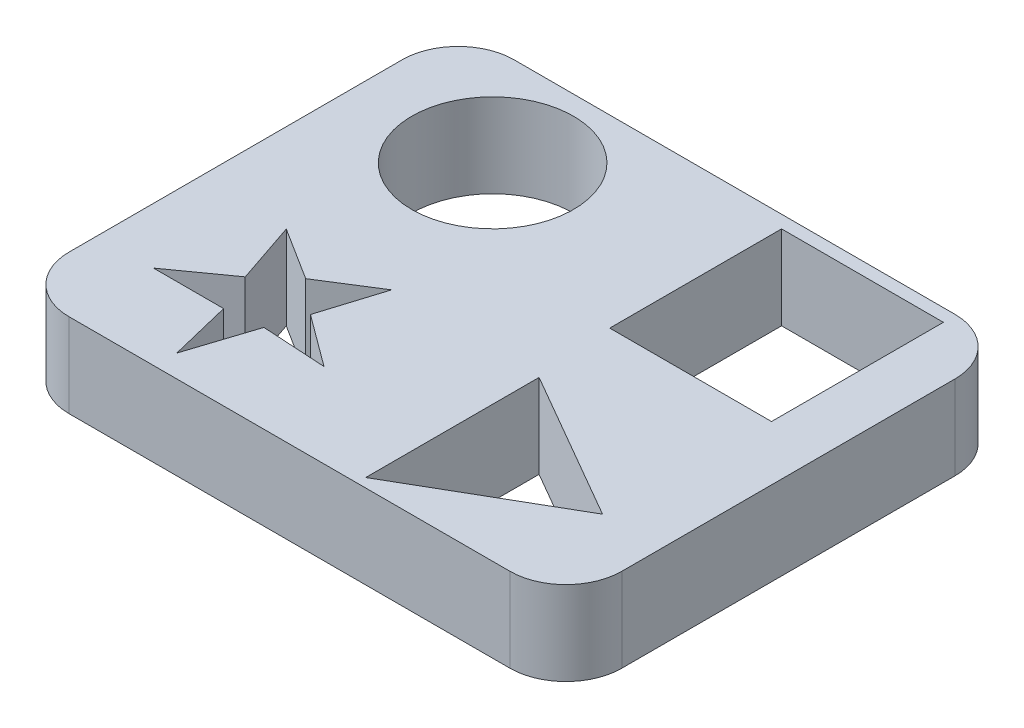
ISO-10303-21;
HEADER;
FILE_DESCRIPTION(('STEP AP214'),'2;1');
FILE_NAME('part.step','',(''),(''),'','','');
FILE_SCHEMA(('AUTOMOTIVE_DESIGN { 1 0 10303 214 1 1 1 1 }'));
ENDSEC;
DATA;
#1=APPLICATION_CONTEXT('core data for automotive mechanical design processes');
#2=APPLICATION_PROTOCOL_DEFINITION('international standard','automotive_design',2000,#1);
#3=PRODUCT_CONTEXT('',#1,'mechanical');
#4=PRODUCT('Part','Part','',(#3));
#5=PRODUCT_RELATED_PRODUCT_CATEGORY('part','',(#4));
#6=PRODUCT_DEFINITION_FORMATION('','',#4);
#7=PRODUCT_DEFINITION_CONTEXT('part definition',#1,'design');
#8=PRODUCT_DEFINITION('design','',#6,#7);
#9=PRODUCT_DEFINITION_SHAPE('','',#8);
#10=(LENGTH_UNIT() NAMED_UNIT(*) SI_UNIT(.MILLI.,.METRE.));
#11=(NAMED_UNIT(*) PLANE_ANGLE_UNIT() SI_UNIT($,.RADIAN.));
#12=(NAMED_UNIT(*) SI_UNIT($,.STERADIAN.) SOLID_ANGLE_UNIT());
#13=UNCERTAINTY_MEASURE_WITH_UNIT(LENGTH_MEASURE(1.E-05),#10,'distance_accuracy_value','');
#14=(GEOMETRIC_REPRESENTATION_CONTEXT(3) GLOBAL_UNCERTAINTY_ASSIGNED_CONTEXT((#13)) GLOBAL_UNIT_ASSIGNED_CONTEXT((#10,
#11,#12)) REPRESENTATION_CONTEXT('',''));
#15=CARTESIAN_POINT('',(0.,0.,0.));
#16=DIRECTION('',(0.,0.,1.));
#17=DIRECTION('',(1.,0.,0.));
#18=AXIS2_PLACEMENT_3D('',#15,#16,#17);
#19=CARTESIAN_POINT('',(6.15117544036753,7.61999999999995,-46.2812088683568));
#20=DIRECTION('',(0.,-1.,0.));
#21=DIRECTION('',(0.,0.,-1.));
#22=AXIS2_PLACEMENT_3D('',#19,#20,#21);
#23=PLANE('',#22);
#24=DIRECTION('',(0.866025403784438,0.,-0.5));
#25=VECTOR('',#24,1.);
#26=CARTESIAN_POINT('',(-7.75829157551048,7.61999999999995,-11.7983996668182));
#27=LINE('',#26,#25);
#28=CARTESIAN_POINT('',(-7.75829157551048,7.61999999999995,-11.7983996668182));
#29=VERTEX_POINT('',#28);
#30=CARTESIAN_POINT('',(5.8675698635448,7.61999999999995,-19.6652944365973));
#31=VERTEX_POINT('',#30);
#32=EDGE_CURVE('E316',#29,#31,#27,.T.);
#33=ORIENTED_EDGE('',*,*,#32,.F.);
#34=DIRECTION('',(0.,0.,1.));
#35=VECTOR('',#34,1.);
#36=CARTESIAN_POINT('',(-7.75829157551048,7.61999999999995,-27.5321892063764));
#37=LINE('',#36,#35);
#38=CARTESIAN_POINT('',(-7.75829157551048,7.61999999999995,-27.5321892063764));
#39=VERTEX_POINT('',#38);
#40=EDGE_CURVE('E324',#39,#29,#37,.T.);
#41=ORIENTED_EDGE('',*,*,#40,.F.);
#42=DIRECTION('',(-0.866025403784439,0.,-0.5));
#43=VECTOR('',#42,1.);
#44=CARTESIAN_POINT('',(5.8675698635448,7.61999999999995,-19.6652944365973));
#45=LINE('',#44,#43);
#46=EDGE_CURVE('E319',#31,#39,#45,.T.);
#47=ORIENTED_EDGE('',*,*,#46,.F.);
#48=EDGE_LOOP('',(#33,#41,#47));
#49=FACE_BOUND('',#48,.T.);
#50=CARTESIAN_POINT('',(6.15117544036753,7.61999999999995,-46.2812088683568));
#51=DIRECTION('',(0.,1.,0.));
#52=DIRECTION('',(0.,0.,-1.));
#53=AXIS2_PLACEMENT_3D('',#50,#51,#52);
#54=CIRCLE('',#53,5.08000000000001);
#55=CARTESIAN_POINT('',(11.2311754403675,7.61999999999995,-46.2812088683568));
#56=VERTEX_POINT('',#55);
#57=CARTESIAN_POINT('',(6.15117544036754,7.61999999999995,-51.3612088683568));
#58=VERTEX_POINT('',#57);
#59=EDGE_CURVE('E400',#56,#58,#54,.T.);
#60=ORIENTED_EDGE('',*,*,#59,.T.);
#61=DIRECTION('',(-1.,0.,0.));
#62=VECTOR('',#61,1.);
#63=CARTESIAN_POINT('',(-33.8538245596325,7.61999999999995,-51.3612088683568));
#64=LINE('',#63,#62);
#65=CARTESIAN_POINT('',(-33.8538245596325,7.61999999999995,-51.3612088683568));
#66=VERTEX_POINT('',#65);
#67=EDGE_CURVE('E404',#58,#66,#64,.T.);
#68=ORIENTED_EDGE('',*,*,#67,.T.);
#69=CARTESIAN_POINT('',(-33.8538245596325,7.61999999999995,-46.2812088683568));
#70=DIRECTION('',(0.,1.,0.));
#71=DIRECTION('',(0.,0.,1.));
#72=AXIS2_PLACEMENT_3D('',#69,#70,#71);
#73=CIRCLE('',#72,5.08);
#74=CARTESIAN_POINT('',(-38.9338245596325,7.61999999999995,-46.2812088683568));
#75=VERTEX_POINT('',#74);
#76=EDGE_CURVE('E408',#66,#75,#73,.T.);
#77=ORIENTED_EDGE('',*,*,#76,.T.);
#78=DIRECTION('',(0.,0.,1.));
#79=VECTOR('',#78,1.);
#80=CARTESIAN_POINT('',(-38.9338245596325,7.61999999999995,-46.2812088683568));
#81=LINE('',#80,#79);
#82=CARTESIAN_POINT('',(-38.9338245596325,7.61999999999995,-16.0552088683568));
#83=VERTEX_POINT('',#82);
#84=EDGE_CURVE('E411',#75,#83,#81,.T.);
#85=ORIENTED_EDGE('',*,*,#84,.T.);
#86=CARTESIAN_POINT('',(-33.8538245596325,7.61999999999995,-16.0552088683568));
#87=DIRECTION('',(0.,1.,0.));
#88=DIRECTION('',(0.,0.,1.));
#89=AXIS2_PLACEMENT_3D('',#86,#87,#88);
#90=CIRCLE('',#89,5.08);
#91=CARTESIAN_POINT('',(-33.8538245596325,7.61999999999995,-10.9752088683568));
#92=VERTEX_POINT('',#91);
#93=EDGE_CURVE('E414',#83,#92,#90,.T.);
#94=ORIENTED_EDGE('',*,*,#93,.T.);
#95=DIRECTION('',(1.,0.,0.));
#96=VECTOR('',#95,1.);
#97=CARTESIAN_POINT('',(-33.8538245596325,7.61999999999995,-10.9752088683568));
#98=LINE('',#97,#96);
#99=CARTESIAN_POINT('',(6.15117544036754,7.61999999999995,-10.9752088683568));
#100=VERTEX_POINT('',#99);
#101=EDGE_CURVE('E417',#92,#100,#98,.T.);
#102=ORIENTED_EDGE('',*,*,#101,.T.);
#103=CARTESIAN_POINT('',(6.15117544036754,7.61999999999995,-16.0552088683568));
#104=DIRECTION('',(0.,1.,0.));
#105=DIRECTION('',(0.,0.,1.));
#106=AXIS2_PLACEMENT_3D('',#103,#104,#105);
#107=CIRCLE('',#106,5.08);
#108=CARTESIAN_POINT('',(11.2311754403675,7.61999999999995,-16.0552088683568));
#109=VERTEX_POINT('',#108);
#110=EDGE_CURVE('E420',#100,#109,#107,.T.);
#111=ORIENTED_EDGE('',*,*,#110,.T.);
#112=DIRECTION('',(0.,0.,-1.));
#113=VECTOR('',#112,1.);
#114=CARTESIAN_POINT('',(11.2311754403675,7.61999999999995,-46.2812088683568));
#115=LINE('',#114,#113);
#116=EDGE_CURVE('E423',#109,#56,#115,.T.);
#117=ORIENTED_EDGE('',*,*,#116,.T.);
#118=EDGE_LOOP('',(#60,#68,#77,#85,#94,#102,#111,#117));
#119=FACE_BOUND('',#118,.T.);
#120=DIRECTION('',(0.,0.,-1.));
#121=VECTOR('',#120,1.);
#122=CARTESIAN_POINT('',(6.2551989286152,7.61999999999995,-50.2080426709111));
#123=LINE('',#122,#121);
#124=CARTESIAN_POINT('',(6.2551989286152,7.61999999999995,-34.6135933478244));
#125=VERTEX_POINT('',#124);
#126=CARTESIAN_POINT('',(6.2551989286152,7.61999999999995,-50.2080426709111));
#127=VERTEX_POINT('',#126);
#128=EDGE_CURVE('E357',#125,#127,#123,.T.);
#129=ORIENTED_EDGE('',*,*,#128,.F.);
#130=DIRECTION('',(1.,0.,0.));
#131=VECTOR('',#130,1.);
#132=CARTESIAN_POINT('',(6.2551989286152,7.61999999999995,-34.6135933478244));
#133=LINE('',#132,#131);
#134=CARTESIAN_POINT('',(-8.42854696194583,7.61999999999995,-34.6135933478244));
#135=VERTEX_POINT('',#134);
#136=EDGE_CURVE('E368',#135,#125,#133,.T.);
#137=ORIENTED_EDGE('',*,*,#136,.F.);
#138=DIRECTION('',(0.,0.,1.));
#139=VECTOR('',#138,1.);
#140=CARTESIAN_POINT('',(-8.42854696194583,7.61999999999995,-50.2080426709111));
#141=LINE('',#140,#139);
#142=CARTESIAN_POINT('',(-8.42854696194583,7.61999999999995,-50.2080426709111));
#143=VERTEX_POINT('',#142);
#144=EDGE_CURVE('E364',#143,#135,#141,.T.);
#145=ORIENTED_EDGE('',*,*,#144,.F.);
#146=DIRECTION('',(-1.,0.,0.));
#147=VECTOR('',#146,1.);
#148=CARTESIAN_POINT('',(6.2551989286152,7.61999999999995,-50.2080426709111));
#149=LINE('',#148,#147);
#150=EDGE_CURVE('E360',#127,#143,#149,.T.);
#151=ORIENTED_EDGE('',*,*,#150,.F.);
#152=EDGE_LOOP('',(#129,#137,#145,#151));
#153=FACE_BOUND('',#152,.T.);
#154=CARTESIAN_POINT('',(-26.7287845306443,7.61999999999995,-42.2880938585788));
#155=DIRECTION('',(0.,1.,0.));
#156=DIRECTION('',(0.,0.,1.));
#157=AXIS2_PLACEMENT_3D('',#154,#155,#156);
#158=CIRCLE('',#157,7.33850889206838);
#159=CARTESIAN_POINT('',(-26.7287845306443,7.61999999999995,-34.9495849665104));
#160=VERTEX_POINT('',#159);
#161=EDGE_CURVE('E349',#160,#160,#158,.T.);
#162=ORIENTED_EDGE('',*,*,#161,.F.);
#163=EDGE_LOOP('',(#162));
#164=FACE_BOUND('',#163,.T.);
#165=DIRECTION('',(1.,0.,0.));
#166=VECTOR('',#165,1.);
#167=CARTESIAN_POINT('',(-27.4791985108445,7.61999999999995,-18.6293191128942));
#168=LINE('',#167,#166);
#169=CARTESIAN_POINT('',(-33.8477430683376,7.61999999999995,-18.6293191128942));
#170=VERTEX_POINT('',#169);
#171=CARTESIAN_POINT('',(-27.4791985108445,7.61999999999995,-18.6293191128942));
#172=VERTEX_POINT('',#171);
#173=EDGE_CURVE('E207',#170,#172,#168,.T.);
#174=ORIENTED_EDGE('',*,*,#173,.F.);
#175=DIRECTION('',(-0.813183962352781,0.,0.582006738253288));
#176=VECTOR('',#175,1.);
#177=CARTESIAN_POINT('',(-33.8477430683376,7.61999999999995,-18.6293191128942));
#178=LINE('',#177,#176);
#179=CARTESIAN_POINT('',(-28.9932779186337,7.61999999999995,-22.1037253463484));
#180=VERTEX_POINT('',#179);
#181=EDGE_CURVE('E254',#180,#170,#178,.T.);
#182=ORIENTED_EDGE('',*,*,#181,.F.);
#183=DIRECTION('',(0.320025610898666,0.,0.947408891856592));
#184=VECTOR('',#183,1.);
#185=CARTESIAN_POINT('',(-28.9932779186337,7.61999999999995,-22.1037253463484));
#186=LINE('',#185,#184);
#187=CARTESIAN_POINT('',(-30.8922365973066,7.61999999999995,-27.7254327228016));
#188=VERTEX_POINT('',#187);
#189=EDGE_CURVE('E251',#188,#180,#186,.T.);
#190=ORIENTED_EDGE('',*,*,#189,.F.);
#191=DIRECTION('',(-0.845502621745261,0.,-0.533971269472328));
#192=VECTOR('',#191,1.);
#193=CARTESIAN_POINT('',(-30.8922365973066,7.61999999999995,-27.7254327228016));
#194=LINE('',#193,#192);
#195=CARTESIAN_POINT('',(-26.1101266732079,7.61999999999995,-24.7053246341284));
#196=VERTEX_POINT('',#195);
#197=EDGE_CURVE('E248',#196,#188,#194,.T.);
#198=ORIENTED_EDGE('',*,*,#197,.F.);
#199=DIRECTION('',(-0.845502621745238,0.,0.533971269472364));
#200=VECTOR('',#199,1.);
#201=CARTESIAN_POINT('',(-26.1101266732079,7.61999999999995,-24.7053246341284));
#202=LINE('',#201,#200);
#203=CARTESIAN_POINT('',(-21.3280167491095,7.61999999999995,-27.7254327228017));
#204=VERTEX_POINT('',#203);
#205=EDGE_CURVE('E245',#204,#196,#202,.T.);
#206=ORIENTED_EDGE('',*,*,#205,.F.);
#207=DIRECTION('',(0.296978964116433,0.,-0.954884021686576));
#208=VECTOR('',#207,1.);
#209=CARTESIAN_POINT('',(-23.0764268128532,7.61999999999995,-22.1037253463484));
#210=LINE('',#209,#208);
#211=CARTESIAN_POINT('',(-23.0764268128532,7.61999999999995,-22.1037253463484));
#212=VERTEX_POINT('',#211);
#213=EDGE_CURVE('E242',#212,#204,#210,.T.);
#214=ORIENTED_EDGE('',*,*,#213,.F.);
#215=DIRECTION('',(-0.804372401510617,0.,-0.594125441037533));
#216=VECTOR('',#215,1.);
#217=CARTESIAN_POINT('',(-18.3725102780783,7.61999999999995,-18.6293191128944));
#218=LINE('',#217,#216);
#219=CARTESIAN_POINT('',(-18.3725102780783,7.61999999999995,-18.6293191128944));
#220=VERTEX_POINT('',#219);
#221=EDGE_CURVE('E239',#220,#212,#218,.T.);
#222=ORIENTED_EDGE('',*,*,#221,.F.);
#223=DIRECTION('',(0.998228907565858,0.,0.0594898991415599));
#224=VECTOR('',#223,1.);
#225=CARTESIAN_POINT('',(-24.1712381899674,7.61999999999995,-18.9748969017292));
#226=LINE('',#225,#224);
#227=CARTESIAN_POINT('',(-24.1712381899674,7.61999999999995,-18.9748969017292));
#228=VERTEX_POINT('',#227);
#229=EDGE_CURVE('E234',#228,#220,#226,.T.);
#230=ORIENTED_EDGE('',*,*,#229,.F.);
#231=DIRECTION('',(0.309016994374938,0.,-0.951056516295157));
#232=VECTOR('',#231,1.);
#233=CARTESIAN_POINT('',(-26.1101266732079,7.61999999999995,-13.0076117364411));
#234=LINE('',#233,#232);
#235=CARTESIAN_POINT('',(-26.1101266732079,7.61999999999995,-13.0076117364411));
#236=VERTEX_POINT('',#235);
#237=EDGE_CURVE('E230',#236,#228,#234,.T.);
#238=ORIENTED_EDGE('',*,*,#237,.F.);
#239=DIRECTION('',(0.236617465882406,0.,0.971602889476657));
#240=VECTOR('',#239,1.);
#241=CARTESIAN_POINT('',(-26.1101266732079,7.61999999999995,-13.0076117364411));
#242=LINE('',#241,#240);
#243=EDGE_CURVE('E216',#172,#236,#242,.T.);
#244=ORIENTED_EDGE('',*,*,#243,.F.);
#245=EDGE_LOOP('',(#174,#182,#190,#198,#206,#214,#222,#230,#238,#244));
#246=FACE_BOUND('',#245,.T.);
#247=ADVANCED_FACE('F39',(#49,#119,#153,#164,#246),#23,.F.);
#248=CARTESIAN_POINT('',(6.15117544036753,0.,-46.2812088683568));
#249=DIRECTION('',(0.,-1.,0.));
#250=DIRECTION('',(0.,0.,-1.));
#251=AXIS2_PLACEMENT_3D('',#248,#249,#250);
#252=PLANE('',#251);
#253=DIRECTION('',(1.,0.,0.));
#254=VECTOR('',#253,1.);
#255=CARTESIAN_POINT('',(6.2551989286152,0.,-34.6135933478244));
#256=LINE('',#255,#254);
#257=CARTESIAN_POINT('',(-8.42854696194583,0.,-34.6135933478244));
#258=VERTEX_POINT('',#257);
#259=CARTESIAN_POINT('',(6.2551989286152,0.,-34.6135933478244));
#260=VERTEX_POINT('',#259);
#261=EDGE_CURVE('E361',#258,#260,#256,.T.);
#262=ORIENTED_EDGE('',*,*,#261,.T.);
#263=DIRECTION('',(0.,0.,-1.));
#264=VECTOR('',#263,1.);
#265=CARTESIAN_POINT('',(6.2551989286152,0.,-50.2080426709111));
#266=LINE('',#265,#264);
#267=CARTESIAN_POINT('',(6.2551989286152,0.,-50.2080426709111));
#268=VERTEX_POINT('',#267);
#269=EDGE_CURVE('E353',#260,#268,#266,.T.);
#270=ORIENTED_EDGE('',*,*,#269,.T.);
#271=DIRECTION('',(-1.,0.,0.));
#272=VECTOR('',#271,1.);
#273=CARTESIAN_POINT('',(6.2551989286152,0.,-50.2080426709111));
#274=LINE('',#273,#272);
#275=CARTESIAN_POINT('',(-8.42854696194583,0.,-50.2080426709111));
#276=VERTEX_POINT('',#275);
#277=EDGE_CURVE('E375',#268,#276,#274,.T.);
#278=ORIENTED_EDGE('',*,*,#277,.T.);
#279=DIRECTION('',(0.,0.,1.));
#280=VECTOR('',#279,1.);
#281=CARTESIAN_POINT('',(-8.42854696194583,0.,-50.2080426709111));
#282=LINE('',#281,#280);
#283=EDGE_CURVE('E379',#276,#258,#282,.T.);
#284=ORIENTED_EDGE('',*,*,#283,.T.);
#285=EDGE_LOOP('',(#262,#270,#278,#284));
#286=FACE_BOUND('',#285,.T.);
#287=CARTESIAN_POINT('',(6.15117544036753,0.,-46.2812088683568));
#288=DIRECTION('',(0.,1.,0.));
#289=DIRECTION('',(0.,0.,-1.));
#290=AXIS2_PLACEMENT_3D('',#287,#288,#289);
#291=CIRCLE('',#290,5.08000000000001);
#292=CARTESIAN_POINT('',(11.2311754403675,0.,-46.2812088683568));
#293=VERTEX_POINT('',#292);
#294=CARTESIAN_POINT('',(6.15117544036754,0.,-51.3612088683568));
#295=VERTEX_POINT('',#294);
#296=EDGE_CURVE('E399',#293,#295,#291,.T.);
#297=ORIENTED_EDGE('',*,*,#296,.F.);
#298=DIRECTION('',(0.,0.,-1.));
#299=VECTOR('',#298,1.);
#300=CARTESIAN_POINT('',(11.2311754403675,0.,-46.2812088683568));
#301=LINE('',#300,#299);
#302=CARTESIAN_POINT('',(11.2311754403675,0.,-16.0552088683568));
#303=VERTEX_POINT('',#302);
#304=EDGE_CURVE('E405',#303,#293,#301,.T.);
#305=ORIENTED_EDGE('',*,*,#304,.F.);
#306=CARTESIAN_POINT('',(6.15117544036754,0.,-16.0552088683568));
#307=DIRECTION('',(0.,1.,0.));
#308=DIRECTION('',(0.,0.,1.));
#309=AXIS2_PLACEMENT_3D('',#306,#307,#308);
#310=CIRCLE('',#309,5.08);
#311=CARTESIAN_POINT('',(6.15117544036754,0.,-10.9752088683568));
#312=VERTEX_POINT('',#311);
#313=EDGE_CURVE('E445',#312,#303,#310,.T.);
#314=ORIENTED_EDGE('',*,*,#313,.F.);
#315=DIRECTION('',(1.,0.,0.));
#316=VECTOR('',#315,1.);
#317=CARTESIAN_POINT('',(-33.8538245596325,0.,-10.9752088683568));
#318=LINE('',#317,#316);
#319=CARTESIAN_POINT('',(-33.8538245596325,0.,-10.9752088683568));
#320=VERTEX_POINT('',#319);
#321=EDGE_CURVE('E442',#320,#312,#318,.T.);
#322=ORIENTED_EDGE('',*,*,#321,.F.);
#323=CARTESIAN_POINT('',(-33.8538245596325,0.,-16.0552088683568));
#324=DIRECTION('',(0.,1.,0.));
#325=DIRECTION('',(0.,0.,1.));
#326=AXIS2_PLACEMENT_3D('',#323,#324,#325);
#327=CIRCLE('',#326,5.08);
#328=CARTESIAN_POINT('',(-38.9338245596325,0.,-16.0552088683568));
#329=VERTEX_POINT('',#328);
#330=EDGE_CURVE('E439',#329,#320,#327,.T.);
#331=ORIENTED_EDGE('',*,*,#330,.F.);
#332=DIRECTION('',(0.,0.,1.));
#333=VECTOR('',#332,1.);
#334=CARTESIAN_POINT('',(-38.9338245596325,0.,-46.2812088683568));
#335=LINE('',#334,#333);
#336=CARTESIAN_POINT('',(-38.9338245596325,0.,-46.2812088683568));
#337=VERTEX_POINT('',#336);
#338=EDGE_CURVE('E436',#337,#329,#335,.T.);
#339=ORIENTED_EDGE('',*,*,#338,.F.);
#340=CARTESIAN_POINT('',(-33.8538245596325,0.,-46.2812088683568));
#341=DIRECTION('',(0.,1.,0.));
#342=DIRECTION('',(0.,0.,1.));
#343=AXIS2_PLACEMENT_3D('',#340,#341,#342);
#344=CIRCLE('',#343,5.08);
#345=CARTESIAN_POINT('',(-33.8538245596325,0.,-51.3612088683568));
#346=VERTEX_POINT('',#345);
#347=EDGE_CURVE('E433',#346,#337,#344,.T.);
#348=ORIENTED_EDGE('',*,*,#347,.F.);
#349=DIRECTION('',(-1.,0.,0.));
#350=VECTOR('',#349,1.);
#351=CARTESIAN_POINT('',(-33.8538245596325,0.,-51.3612088683568));
#352=LINE('',#351,#350);
#353=EDGE_CURVE('E430',#295,#346,#352,.T.);
#354=ORIENTED_EDGE('',*,*,#353,.F.);
#355=EDGE_LOOP('',(#297,#305,#314,#322,#331,#339,#348,#354));
#356=FACE_BOUND('',#355,.T.);
#357=CARTESIAN_POINT('',(-26.7287845306443,0.,-42.2880938585788));
#358=DIRECTION('',(0.,1.,0.));
#359=DIRECTION('',(0.,0.,1.));
#360=AXIS2_PLACEMENT_3D('',#357,#358,#359);
#361=CIRCLE('',#360,7.33850889206838);
#362=CARTESIAN_POINT('',(-26.7287845306443,0.,-34.9495849665104));
#363=VERTEX_POINT('',#362);
#364=EDGE_CURVE('E348',#363,#363,#361,.T.);
#365=ORIENTED_EDGE('',*,*,#364,.T.);
#366=EDGE_LOOP('',(#365));
#367=FACE_BOUND('',#366,.T.);
#368=DIRECTION('',(0.,0.,1.));
#369=VECTOR('',#368,1.);
#370=CARTESIAN_POINT('',(-7.75829157551048,0.,-27.5321892063764));
#371=LINE('',#370,#369);
#372=CARTESIAN_POINT('',(-7.75829157551048,0.,-27.5321892063764));
#373=VERTEX_POINT('',#372);
#374=CARTESIAN_POINT('',(-7.75829157551048,0.,-11.7983996668182));
#375=VERTEX_POINT('',#374);
#376=EDGE_CURVE('E320',#373,#375,#371,.T.);
#377=ORIENTED_EDGE('',*,*,#376,.T.);
#378=DIRECTION('',(0.866025403784438,0.,-0.5));
#379=VECTOR('',#378,1.);
#380=CARTESIAN_POINT('',(-7.75829157551048,0.,-11.7983996668182));
#381=LINE('',#380,#379);
#382=CARTESIAN_POINT('',(5.8675698635448,0.,-19.6652944365973));
#383=VERTEX_POINT('',#382);
#384=EDGE_CURVE('E225',#375,#383,#381,.T.);
#385=ORIENTED_EDGE('',*,*,#384,.T.);
#386=DIRECTION('',(-0.866025403784439,0.,-0.5));
#387=VECTOR('',#386,1.);
#388=CARTESIAN_POINT('',(5.8675698635448,0.,-19.6652944365973));
#389=LINE('',#388,#387);
#390=EDGE_CURVE('E331',#383,#373,#389,.T.);
#391=ORIENTED_EDGE('',*,*,#390,.T.);
#392=EDGE_LOOP('',(#377,#385,#391));
#393=FACE_BOUND('',#392,.T.);
#394=DIRECTION('',(-0.813183962352781,0.,0.582006738253288));
#395=VECTOR('',#394,1.);
#396=CARTESIAN_POINT('',(-33.8477430683376,0.,-18.6293191128942));
#397=LINE('',#396,#395);
#398=CARTESIAN_POINT('',(-28.9932779186337,0.,-22.1037253463484));
#399=VERTEX_POINT('',#398);
#400=CARTESIAN_POINT('',(-33.8477430683376,0.,-18.6293191128942));
#401=VERTEX_POINT('',#400);
#402=EDGE_CURVE('E217',#399,#401,#397,.T.);
#403=ORIENTED_EDGE('',*,*,#402,.T.);
#404=DIRECTION('',(1.,0.,0.));
#405=VECTOR('',#404,1.);
#406=CARTESIAN_POINT('',(-27.4791985108445,0.,-18.6293191128942));
#407=LINE('',#406,#405);
#408=CARTESIAN_POINT('',(-27.4791985108445,0.,-18.6293191128942));
#409=VERTEX_POINT('',#408);
#410=EDGE_CURVE('E63',#401,#409,#407,.T.);
#411=ORIENTED_EDGE('',*,*,#410,.T.);
#412=DIRECTION('',(0.236617465882406,0.,0.971602889476657));
#413=VECTOR('',#412,1.);
#414=CARTESIAN_POINT('',(-26.1101266732079,0.,-13.0076117364411));
#415=LINE('',#414,#413);
#416=CARTESIAN_POINT('',(-26.1101266732079,0.,-13.0076117364411));
#417=VERTEX_POINT('',#416);
#418=EDGE_CURVE('E223',#409,#417,#415,.T.);
#419=ORIENTED_EDGE('',*,*,#418,.T.);
#420=DIRECTION('',(0.309016994374938,0.,-0.951056516295157));
#421=VECTOR('',#420,1.);
#422=CARTESIAN_POINT('',(-26.1101266732079,0.,-13.0076117364411));
#423=LINE('',#422,#421);
#424=CARTESIAN_POINT('',(-24.1712381899674,0.,-18.9748969017292));
#425=VERTEX_POINT('',#424);
#426=EDGE_CURVE('E261',#417,#425,#423,.T.);
#427=ORIENTED_EDGE('',*,*,#426,.T.);
#428=DIRECTION('',(0.998228907565858,0.,0.0594898991415599));
#429=VECTOR('',#428,1.);
#430=CARTESIAN_POINT('',(-24.1712381899674,0.,-18.9748969017292));
#431=LINE('',#430,#429);
#432=CARTESIAN_POINT('',(-18.3725102780783,0.,-18.6293191128944));
#433=VERTEX_POINT('',#432);
#434=EDGE_CURVE('E265',#425,#433,#431,.T.);
#435=ORIENTED_EDGE('',*,*,#434,.T.);
#436=DIRECTION('',(-0.804372401510617,0.,-0.594125441037533));
#437=VECTOR('',#436,1.);
#438=CARTESIAN_POINT('',(-18.3725102780783,0.,-18.6293191128944));
#439=LINE('',#438,#437);
#440=CARTESIAN_POINT('',(-23.0764268128532,0.,-22.1037253463484));
#441=VERTEX_POINT('',#440);
#442=EDGE_CURVE('E269',#433,#441,#439,.T.);
#443=ORIENTED_EDGE('',*,*,#442,.T.);
#444=DIRECTION('',(0.296978964116433,0.,-0.954884021686576));
#445=VECTOR('',#444,1.);
#446=CARTESIAN_POINT('',(-23.0764268128532,0.,-22.1037253463484));
#447=LINE('',#446,#445);
#448=CARTESIAN_POINT('',(-21.3280167491095,0.,-27.7254327228017));
#449=VERTEX_POINT('',#448);
#450=EDGE_CURVE('E273',#441,#449,#447,.T.);
#451=ORIENTED_EDGE('',*,*,#450,.T.);
#452=DIRECTION('',(-0.845502621745238,0.,0.533971269472364));
#453=VECTOR('',#452,1.);
#454=CARTESIAN_POINT('',(-26.1101266732079,0.,-24.7053246341284));
#455=LINE('',#454,#453);
#456=CARTESIAN_POINT('',(-26.1101266732079,0.,-24.7053246341284));
#457=VERTEX_POINT('',#456);
#458=EDGE_CURVE('E277',#449,#457,#455,.T.);
#459=ORIENTED_EDGE('',*,*,#458,.T.);
#460=DIRECTION('',(-0.845502621745261,0.,-0.533971269472328));
#461=VECTOR('',#460,1.);
#462=CARTESIAN_POINT('',(-30.8922365973066,0.,-27.7254327228016));
#463=LINE('',#462,#461);
#464=CARTESIAN_POINT('',(-30.8922365973066,0.,-27.7254327228016));
#465=VERTEX_POINT('',#464);
#466=EDGE_CURVE('E281',#457,#465,#463,.T.);
#467=ORIENTED_EDGE('',*,*,#466,.T.);
#468=DIRECTION('',(0.320025610898666,0.,0.947408891856592));
#469=VECTOR('',#468,1.);
#470=CARTESIAN_POINT('',(-28.9932779186337,0.,-22.1037253463484));
#471=LINE('',#470,#469);
#472=EDGE_CURVE('E285',#465,#399,#471,.T.);
#473=ORIENTED_EDGE('',*,*,#472,.T.);
#474=EDGE_LOOP('',(#403,#411,#419,#427,#435,#443,#451,#459,#467,#473));
#475=FACE_BOUND('',#474,.T.);
#476=ADVANCED_FACE('F484',(#286,#356,#367,#393,#475),#252,.T.);
#477=CARTESIAN_POINT('',(6.15117544036753,7.61999999999995,-46.2812088683568));
#478=DIRECTION('',(0.,-1.,0.));
#479=DIRECTION('',(0.,0.,-1.));
#480=AXIS2_PLACEMENT_3D('',#477,#478,#479);
#481=CYLINDRICAL_SURFACE('',#480,5.08000000000001);
#482=ORIENTED_EDGE('',*,*,#296,.T.);
#483=DIRECTION('',(0.,-1.,0.));
#484=VECTOR('',#483,1.);
#485=CARTESIAN_POINT('',(6.15117544036754,7.61999999999995,-51.3612088683568));
#486=LINE('',#485,#484);
#487=EDGE_CURVE('E11',#58,#295,#486,.T.);
#488=ORIENTED_EDGE('',*,*,#487,.F.);
#489=ORIENTED_EDGE('',*,*,#59,.F.);
#490=DIRECTION('',(0.,-1.,0.));
#491=VECTOR('',#490,1.);
#492=CARTESIAN_POINT('',(11.2311754403675,7.61999999999995,-46.2812088683568));
#493=LINE('',#492,#491);
#494=EDGE_CURVE('E426',#56,#293,#493,.T.);
#495=ORIENTED_EDGE('',*,*,#494,.T.);
#496=EDGE_LOOP('',(#482,#488,#489,#495));
#497=FACE_BOUND('',#496,.T.);
#498=ADVANCED_FACE('F41',(#497),#481,.T.);
#499=CARTESIAN_POINT('',(-33.8538245596325,7.61999999999995,-51.3612088683568));
#500=DIRECTION('',(0.,0.,1.));
#501=DIRECTION('',(1.,0.,0.));
#502=AXIS2_PLACEMENT_3D('',#499,#500,#501);
#503=PLANE('',#502);
#504=ORIENTED_EDGE('',*,*,#353,.T.);
#505=DIRECTION('',(0.,-1.,0.));
#506=VECTOR('',#505,1.);
#507=CARTESIAN_POINT('',(-33.8538245596325,7.61999999999995,-51.3612088683568));
#508=LINE('',#507,#506);
#509=EDGE_CURVE('E48',#66,#346,#508,.T.);
#510=ORIENTED_EDGE('',*,*,#509,.F.);
#511=ORIENTED_EDGE('',*,*,#67,.F.);
#512=ORIENTED_EDGE('',*,*,#487,.T.);
#513=EDGE_LOOP('',(#504,#510,#511,#512));
#514=FACE_BOUND('',#513,.T.);
#515=ADVANCED_FACE('F502',(#514),#503,.F.);
#516=CARTESIAN_POINT('',(-33.8538245596325,7.61999999999995,-46.2812088683568));
#517=DIRECTION('',(0.,-1.,0.));
#518=DIRECTION('',(0.,0.,-1.));
#519=AXIS2_PLACEMENT_3D('',#516,#517,#518);
#520=CYLINDRICAL_SURFACE('',#519,5.08);
#521=ORIENTED_EDGE('',*,*,#347,.T.);
#522=DIRECTION('',(0.,-1.,0.));
#523=VECTOR('',#522,1.);
#524=CARTESIAN_POINT('',(-38.9338245596325,7.61999999999995,-46.2812088683568));
#525=LINE('',#524,#523);
#526=EDGE_CURVE('E469',#75,#337,#525,.T.);
#527=ORIENTED_EDGE('',*,*,#526,.F.);
#528=ORIENTED_EDGE('',*,*,#76,.F.);
#529=ORIENTED_EDGE('',*,*,#509,.T.);
#530=EDGE_LOOP('',(#521,#527,#528,#529));
#531=FACE_BOUND('',#530,.T.);
#532=ADVANCED_FACE('F478',(#531),#520,.T.);
#533=CARTESIAN_POINT('',(-38.9338245596325,7.61999999999995,-46.2812088683568));
#534=DIRECTION('',(1.,0.,0.));
#535=DIRECTION('',(0.,0.,-1.));
#536=AXIS2_PLACEMENT_3D('',#533,#534,#535);
#537=PLANE('',#536);
#538=ORIENTED_EDGE('',*,*,#338,.T.);
#539=DIRECTION('',(0.,-1.,0.));
#540=VECTOR('',#539,1.);
#541=CARTESIAN_POINT('',(-38.9338245596325,7.61999999999995,-16.0552088683568));
#542=LINE('',#541,#540);
#543=EDGE_CURVE('E465',#83,#329,#542,.T.);
#544=ORIENTED_EDGE('',*,*,#543,.F.);
#545=ORIENTED_EDGE('',*,*,#84,.F.);
#546=ORIENTED_EDGE('',*,*,#526,.T.);
#547=EDGE_LOOP('',(#538,#544,#545,#546));
#548=FACE_BOUND('',#547,.T.);
#549=ADVANCED_FACE('F490',(#548),#537,.F.);
#550=CARTESIAN_POINT('',(-33.8538245596325,7.61999999999995,-16.0552088683568));
#551=DIRECTION('',(0.,-1.,0.));
#552=DIRECTION('',(0.,0.,-1.));
#553=AXIS2_PLACEMENT_3D('',#550,#551,#552);
#554=CYLINDRICAL_SURFACE('',#553,5.08);
#555=ORIENTED_EDGE('',*,*,#330,.T.);
#556=DIRECTION('',(0.,-1.,0.));
#557=VECTOR('',#556,1.);
#558=CARTESIAN_POINT('',(-33.8538245596325,7.61999999999995,-10.9752088683568));
#559=LINE('',#558,#557);
#560=EDGE_CURVE('E461',#92,#320,#559,.T.);
#561=ORIENTED_EDGE('',*,*,#560,.F.);
#562=ORIENTED_EDGE('',*,*,#93,.F.);
#563=ORIENTED_EDGE('',*,*,#543,.T.);
#564=EDGE_LOOP('',(#555,#561,#562,#563));
#565=FACE_BOUND('',#564,.T.);
#566=ADVANCED_FACE('F494',(#565),#554,.T.);
#567=CARTESIAN_POINT('',(-33.8538245596325,7.61999999999995,-10.9752088683568));
#568=DIRECTION('',(0.,0.,-1.));
#569=DIRECTION('',(-1.,0.,0.));
#570=AXIS2_PLACEMENT_3D('',#567,#568,#569);
#571=PLANE('',#570);
#572=ORIENTED_EDGE('',*,*,#321,.T.);
#573=DIRECTION('',(0.,-1.,0.));
#574=VECTOR('',#573,1.);
#575=CARTESIAN_POINT('',(6.15117544036754,7.61999999999995,-10.9752088683568));
#576=LINE('',#575,#574);
#577=EDGE_CURVE('E457',#100,#312,#576,.T.);
#578=ORIENTED_EDGE('',*,*,#577,.F.);
#579=ORIENTED_EDGE('',*,*,#101,.F.);
#580=ORIENTED_EDGE('',*,*,#560,.T.);
#581=EDGE_LOOP('',(#572,#578,#579,#580));
#582=FACE_BOUND('',#581,.T.);
#583=ADVANCED_FACE('F515',(#582),#571,.F.);
#584=CARTESIAN_POINT('',(6.15117544036754,7.61999999999995,-16.0552088683568));
#585=DIRECTION('',(0.,-1.,0.));
#586=DIRECTION('',(0.,0.,-1.));
#587=AXIS2_PLACEMENT_3D('',#584,#585,#586);
#588=CYLINDRICAL_SURFACE('',#587,5.08);
#589=ORIENTED_EDGE('',*,*,#313,.T.);
#590=DIRECTION('',(0.,-1.,0.));
#591=VECTOR('',#590,1.);
#592=CARTESIAN_POINT('',(11.2311754403675,7.61999999999995,-16.0552088683568));
#593=LINE('',#592,#591);
#594=EDGE_CURVE('E453',#109,#303,#593,.T.);
#595=ORIENTED_EDGE('',*,*,#594,.F.);
#596=ORIENTED_EDGE('',*,*,#110,.F.);
#597=ORIENTED_EDGE('',*,*,#577,.T.);
#598=EDGE_LOOP('',(#589,#595,#596,#597));
#599=FACE_BOUND('',#598,.T.);
#600=ADVANCED_FACE('F513',(#599),#588,.T.);
#601=CARTESIAN_POINT('',(11.2311754403675,7.61999999999995,-46.2812088683568));
#602=DIRECTION('',(-1.,0.,0.));
#603=DIRECTION('',(0.,0.,1.));
#604=AXIS2_PLACEMENT_3D('',#601,#602,#603);
#605=PLANE('',#604);
#606=ORIENTED_EDGE('',*,*,#304,.T.);
#607=ORIENTED_EDGE('',*,*,#494,.F.);
#608=ORIENTED_EDGE('',*,*,#116,.F.);
#609=ORIENTED_EDGE('',*,*,#594,.T.);
#610=EDGE_LOOP('',(#606,#607,#608,#609));
#611=FACE_BOUND('',#610,.T.);
#612=ADVANCED_FACE('F508',(#611),#605,.F.);
#613=CARTESIAN_POINT('',(6.2551989286152,7.61999999999995,-50.2080426709111));
#614=DIRECTION('',(-1.,0.,0.));
#615=DIRECTION('',(0.,0.,1.));
#616=AXIS2_PLACEMENT_3D('',#613,#614,#615);
#617=PLANE('',#616);
#618=ORIENTED_EDGE('',*,*,#269,.F.);
#619=DIRECTION('',(0.,-1.,0.));
#620=VECTOR('',#619,1.);
#621=CARTESIAN_POINT('',(6.2551989286152,7.61999999999995,-34.6135933478244));
#622=LINE('',#621,#620);
#623=EDGE_CURVE('E371',#125,#260,#622,.T.);
#624=ORIENTED_EDGE('',*,*,#623,.F.);
#625=ORIENTED_EDGE('',*,*,#128,.T.);
#626=DIRECTION('',(0.,-1.,0.));
#627=VECTOR('',#626,1.);
#628=CARTESIAN_POINT('',(6.2551989286152,7.61999999999995,-50.2080426709111));
#629=LINE('',#628,#627);
#630=EDGE_CURVE('E395',#127,#268,#629,.T.);
#631=ORIENTED_EDGE('',*,*,#630,.T.);
#632=EDGE_LOOP('',(#618,#624,#625,#631));
#633=FACE_BOUND('',#632,.T.);
#634=ADVANCED_FACE('F534',(#633),#617,.T.);
#635=CARTESIAN_POINT('',(6.2551989286152,7.61999999999995,-50.2080426709111));
#636=DIRECTION('',(0.,0.,1.));
#637=DIRECTION('',(1.,0.,0.));
#638=AXIS2_PLACEMENT_3D('',#635,#636,#637);
#639=PLANE('',#638);
#640=ORIENTED_EDGE('',*,*,#277,.F.);
#641=ORIENTED_EDGE('',*,*,#630,.F.);
#642=ORIENTED_EDGE('',*,*,#150,.T.);
#643=DIRECTION('',(0.,-1.,0.));
#644=VECTOR('',#643,1.);
#645=CARTESIAN_POINT('',(-8.42854696194583,7.61999999999995,-50.2080426709111));
#646=LINE('',#645,#644);
#647=EDGE_CURVE('E392',#143,#276,#646,.T.);
#648=ORIENTED_EDGE('',*,*,#647,.T.);
#649=EDGE_LOOP('',(#640,#641,#642,#648));
#650=FACE_BOUND('',#649,.T.);
#651=ADVANCED_FACE('F541',(#650),#639,.T.);
#652=CARTESIAN_POINT('',(-8.42854696194583,7.61999999999995,-50.2080426709111));
#653=DIRECTION('',(1.,0.,0.));
#654=DIRECTION('',(0.,0.,-1.));
#655=AXIS2_PLACEMENT_3D('',#652,#653,#654);
#656=PLANE('',#655);
#657=ORIENTED_EDGE('',*,*,#283,.F.);
#658=ORIENTED_EDGE('',*,*,#647,.F.);
#659=ORIENTED_EDGE('',*,*,#144,.T.);
#660=DIRECTION('',(0.,-1.,0.));
#661=VECTOR('',#660,1.);
#662=CARTESIAN_POINT('',(-8.42854696194583,7.61999999999995,-34.6135933478244));
#663=LINE('',#662,#661);
#664=EDGE_CURVE('E389',#135,#258,#663,.T.);
#665=ORIENTED_EDGE('',*,*,#664,.T.);
#666=EDGE_LOOP('',(#657,#658,#659,#665));
#667=FACE_BOUND('',#666,.T.);
#668=ADVANCED_FACE('F546',(#667),#656,.T.);
#669=CARTESIAN_POINT('',(6.2551989286152,7.61999999999995,-34.6135933478244));
#670=DIRECTION('',(0.,0.,-1.));
#671=DIRECTION('',(-1.,0.,0.));
#672=AXIS2_PLACEMENT_3D('',#669,#670,#671);
#673=PLANE('',#672);
#674=ORIENTED_EDGE('',*,*,#261,.F.);
#675=ORIENTED_EDGE('',*,*,#664,.F.);
#676=ORIENTED_EDGE('',*,*,#136,.T.);
#677=ORIENTED_EDGE('',*,*,#623,.T.);
#678=EDGE_LOOP('',(#674,#675,#676,#677));
#679=FACE_BOUND('',#678,.T.);
#680=ADVANCED_FACE('F553',(#679),#673,.T.);
#681=CARTESIAN_POINT('',(-26.7287845306443,7.61999999999995,-42.2880938585788));
#682=DIRECTION('',(0.,-1.,0.));
#683=DIRECTION('',(0.,0.,-1.));
#684=AXIS2_PLACEMENT_3D('',#681,#682,#683);
#685=CYLINDRICAL_SURFACE('',#684,7.33850889206838);
#686=ORIENTED_EDGE('',*,*,#161,.T.);
#687=EDGE_LOOP('',(#686));
#688=FACE_BOUND('',#687,.T.);
#689=ORIENTED_EDGE('',*,*,#364,.F.);
#690=EDGE_LOOP('',(#689));
#691=FACE_BOUND('',#690,.T.);
#692=ADVANCED_FACE('F563',(#688,#691),#685,.F.);
#693=CARTESIAN_POINT('',(-7.75829157551048,7.61999999999995,-11.7983996668182));
#694=DIRECTION('',(-0.5,0.,-0.866025403784438));
#695=DIRECTION('',(-0.866025403784439,0.,0.5));
#696=AXIS2_PLACEMENT_3D('',#693,#694,#695);
#697=PLANE('',#696);
#698=ORIENTED_EDGE('',*,*,#384,.F.);
#699=DIRECTION('',(0.,-1.,0.));
#700=VECTOR('',#699,1.);
#701=CARTESIAN_POINT('',(-7.75829157551048,7.61999999999995,-11.7983996668182));
#702=LINE('',#701,#700);
#703=EDGE_CURVE('E327',#29,#375,#702,.T.);
#704=ORIENTED_EDGE('',*,*,#703,.F.);
#705=ORIENTED_EDGE('',*,*,#32,.T.);
#706=DIRECTION('',(0.,-1.,0.));
#707=VECTOR('',#706,1.);
#708=CARTESIAN_POINT('',(5.8675698635448,7.61999999999995,-19.6652944365973));
#709=LINE('',#708,#707);
#710=EDGE_CURVE('E344',#31,#383,#709,.T.);
#711=ORIENTED_EDGE('',*,*,#710,.T.);
#712=EDGE_LOOP('',(#698,#704,#705,#711));
#713=FACE_BOUND('',#712,.T.);
#714=ADVANCED_FACE('F566',(#713),#697,.T.);
#715=CARTESIAN_POINT('',(5.8675698635448,7.61999999999995,-19.6652944365973));
#716=DIRECTION('',(-0.5,0.,0.866025403784439));
#717=DIRECTION('',(0.866025403784439,0.,0.5));
#718=AXIS2_PLACEMENT_3D('',#715,#716,#717);
#719=PLANE('',#718);
#720=ORIENTED_EDGE('',*,*,#390,.F.);
#721=ORIENTED_EDGE('',*,*,#710,.F.);
#722=ORIENTED_EDGE('',*,*,#46,.T.);
#723=DIRECTION('',(0.,-1.,0.));
#724=VECTOR('',#723,1.);
#725=CARTESIAN_POINT('',(-7.75829157551048,7.61999999999995,-27.5321892063764));
#726=LINE('',#725,#724);
#727=EDGE_CURVE('E341',#39,#373,#726,.T.);
#728=ORIENTED_EDGE('',*,*,#727,.T.);
#729=EDGE_LOOP('',(#720,#721,#722,#728));
#730=FACE_BOUND('',#729,.T.);
#731=ADVANCED_FACE('F620',(#730),#719,.T.);
#732=CARTESIAN_POINT('',(-7.75829157551048,7.61999999999995,-27.5321892063764));
#733=DIRECTION('',(1.,0.,0.));
#734=DIRECTION('',(0.,0.,-1.));
#735=AXIS2_PLACEMENT_3D('',#732,#733,#734);
#736=PLANE('',#735);
#737=ORIENTED_EDGE('',*,*,#376,.F.);
#738=ORIENTED_EDGE('',*,*,#727,.F.);
#739=ORIENTED_EDGE('',*,*,#40,.T.);
#740=ORIENTED_EDGE('',*,*,#703,.T.);
#741=EDGE_LOOP('',(#737,#738,#739,#740));
#742=FACE_BOUND('',#741,.T.);
#743=ADVANCED_FACE('F617',(#742),#736,.T.);
#744=CARTESIAN_POINT('',(-27.4791985108445,7.61999999999995,-18.6293191128942));
#745=DIRECTION('',(0.,0.,-1.));
#746=DIRECTION('',(-1.,0.,0.));
#747=AXIS2_PLACEMENT_3D('',#744,#745,#746);
#748=PLANE('',#747);
#749=ORIENTED_EDGE('',*,*,#410,.F.);
#750=DIRECTION('',(0.,-1.,0.));
#751=VECTOR('',#750,1.);
#752=CARTESIAN_POINT('',(-33.8477430683376,7.61999999999995,-18.6293191128942));
#753=LINE('',#752,#751);
#754=EDGE_CURVE('E211',#170,#401,#753,.T.);
#755=ORIENTED_EDGE('',*,*,#754,.F.);
#756=ORIENTED_EDGE('',*,*,#173,.T.);
#757=DIRECTION('',(0.,-1.,0.));
#758=VECTOR('',#757,1.);
#759=CARTESIAN_POINT('',(-27.4791985108445,7.61999999999995,-18.6293191128942));
#760=LINE('',#759,#758);
#761=EDGE_CURVE('E210',#172,#409,#760,.T.);
#762=ORIENTED_EDGE('',*,*,#761,.T.);
#763=EDGE_LOOP('',(#749,#755,#756,#762));
#764=FACE_BOUND('',#763,.T.);
#765=ADVANCED_FACE('F209',(#764),#748,.T.);
#766=CARTESIAN_POINT('',(-26.1101266732079,7.61999999999995,-13.0076117364411));
#767=DIRECTION('',(0.971602889476657,0.,-0.236617465882406));
#768=DIRECTION('',(-0.236617465882406,0.,-0.971602889476657));
#769=AXIS2_PLACEMENT_3D('',#766,#767,#768);
#770=PLANE('',#769);
#771=ORIENTED_EDGE('',*,*,#418,.F.);
#772=ORIENTED_EDGE('',*,*,#761,.F.);
#773=ORIENTED_EDGE('',*,*,#243,.T.);
#774=DIRECTION('',(0.,-1.,0.));
#775=VECTOR('',#774,1.);
#776=CARTESIAN_POINT('',(-26.1101266732079,7.61999999999995,-13.0076117364411));
#777=LINE('',#776,#775);
#778=EDGE_CURVE('E226',#236,#417,#777,.T.);
#779=ORIENTED_EDGE('',*,*,#778,.T.);
#780=EDGE_LOOP('',(#771,#772,#773,#779));
#781=FACE_BOUND('',#780,.T.);
#782=ADVANCED_FACE('F220',(#781),#770,.T.);
#783=CARTESIAN_POINT('',(-26.1101266732079,7.61999999999995,-13.0076117364411));
#784=DIRECTION('',(-0.951056516295157,0.,-0.309016994374938));
#785=DIRECTION('',(-0.309016994374938,0.,0.951056516295157));
#786=AXIS2_PLACEMENT_3D('',#783,#784,#785);
#787=PLANE('',#786);
#788=ORIENTED_EDGE('',*,*,#426,.F.);
#789=ORIENTED_EDGE('',*,*,#778,.F.);
#790=ORIENTED_EDGE('',*,*,#237,.T.);
#791=DIRECTION('',(0.,-1.,0.));
#792=VECTOR('',#791,1.);
#793=CARTESIAN_POINT('',(-24.1712381899674,7.61999999999995,-18.9748969017292));
#794=LINE('',#793,#792);
#795=EDGE_CURVE('E311',#228,#425,#794,.T.);
#796=ORIENTED_EDGE('',*,*,#795,.T.);
#797=EDGE_LOOP('',(#788,#789,#790,#796));
#798=FACE_BOUND('',#797,.T.);
#799=ADVANCED_FACE('F604',(#798),#787,.T.);
#800=CARTESIAN_POINT('',(-24.1712381899674,7.61999999999995,-18.9748969017292));
#801=DIRECTION('',(0.0594898991415599,0.,-0.998228907565858));
#802=DIRECTION('',(-0.998228907565859,0.,-0.0594898991415599));
#803=AXIS2_PLACEMENT_3D('',#800,#801,#802);
#804=PLANE('',#803);
#805=ORIENTED_EDGE('',*,*,#434,.F.);
#806=ORIENTED_EDGE('',*,*,#795,.F.);
#807=ORIENTED_EDGE('',*,*,#229,.T.);
#808=DIRECTION('',(0.,-1.,0.));
#809=VECTOR('',#808,1.);
#810=CARTESIAN_POINT('',(-18.3725102780783,7.61999999999995,-18.6293191128944));
#811=LINE('',#810,#809);
#812=EDGE_CURVE('E308',#220,#433,#811,.T.);
#813=ORIENTED_EDGE('',*,*,#812,.T.);
#814=EDGE_LOOP('',(#805,#806,#807,#813));
#815=FACE_BOUND('',#814,.T.);
#816=ADVANCED_FACE('F600',(#815),#804,.T.);
#817=CARTESIAN_POINT('',(-18.3725102780783,7.61999999999995,-18.6293191128944));
#818=DIRECTION('',(-0.594125441037533,0.,0.804372401510617));
#819=DIRECTION('',(0.804372401510617,0.,0.594125441037533));
#820=AXIS2_PLACEMENT_3D('',#817,#818,#819);
#821=PLANE('',#820);
#822=ORIENTED_EDGE('',*,*,#442,.F.);
#823=ORIENTED_EDGE('',*,*,#812,.F.);
#824=ORIENTED_EDGE('',*,*,#221,.T.);
#825=DIRECTION('',(0.,-1.,0.));
#826=VECTOR('',#825,1.);
#827=CARTESIAN_POINT('',(-23.0764268128532,7.61999999999995,-22.1037253463484));
#828=LINE('',#827,#826);
#829=EDGE_CURVE('E305',#212,#441,#828,.T.);
#830=ORIENTED_EDGE('',*,*,#829,.T.);
#831=EDGE_LOOP('',(#822,#823,#824,#830));
#832=FACE_BOUND('',#831,.T.);
#833=ADVANCED_FACE('F596',(#832),#821,.T.);
#834=CARTESIAN_POINT('',(-23.0764268128532,7.61999999999995,-22.1037253463484));
#835=DIRECTION('',(-0.954884021686576,0.,-0.296978964116433));
#836=DIRECTION('',(-0.296978964116433,0.,0.954884021686577));
#837=AXIS2_PLACEMENT_3D('',#834,#835,#836);
#838=PLANE('',#837);
#839=ORIENTED_EDGE('',*,*,#450,.F.);
#840=ORIENTED_EDGE('',*,*,#829,.F.);
#841=ORIENTED_EDGE('',*,*,#213,.T.);
#842=DIRECTION('',(0.,-1.,0.));
#843=VECTOR('',#842,1.);
#844=CARTESIAN_POINT('',(-21.3280167491095,7.61999999999995,-27.7254327228017));
#845=LINE('',#844,#843);
#846=EDGE_CURVE('E302',#204,#449,#845,.T.);
#847=ORIENTED_EDGE('',*,*,#846,.T.);
#848=EDGE_LOOP('',(#839,#840,#841,#847));
#849=FACE_BOUND('',#848,.T.);
#850=ADVANCED_FACE('F593',(#849),#838,.T.);
#851=CARTESIAN_POINT('',(-26.1101266732079,7.61999999999995,-24.7053246341284));
#852=DIRECTION('',(0.533971269472364,0.,0.845502621745238));
#853=DIRECTION('',(0.845502621745239,0.,-0.533971269472364));
#854=AXIS2_PLACEMENT_3D('',#851,#852,#853);
#855=PLANE('',#854);
#856=ORIENTED_EDGE('',*,*,#458,.F.);
#857=ORIENTED_EDGE('',*,*,#846,.F.);
#858=ORIENTED_EDGE('',*,*,#205,.T.);
#859=DIRECTION('',(0.,-1.,0.));
#860=VECTOR('',#859,1.);
#861=CARTESIAN_POINT('',(-26.1101266732079,7.61999999999995,-24.7053246341284));
#862=LINE('',#861,#860);
#863=EDGE_CURVE('E299',#196,#457,#862,.T.);
#864=ORIENTED_EDGE('',*,*,#863,.T.);
#865=EDGE_LOOP('',(#856,#857,#858,#864));
#866=FACE_BOUND('',#865,.T.);
#867=ADVANCED_FACE('F586',(#866),#855,.T.);
#868=CARTESIAN_POINT('',(-30.8922365973066,7.61999999999995,-27.7254327228016));
#869=DIRECTION('',(-0.533971269472328,0.,0.845502621745261));
#870=DIRECTION('',(0.845502621745261,0.,0.533971269472328));
#871=AXIS2_PLACEMENT_3D('',#868,#869,#870);
#872=PLANE('',#871);
#873=ORIENTED_EDGE('',*,*,#466,.F.);
#874=ORIENTED_EDGE('',*,*,#863,.F.);
#875=ORIENTED_EDGE('',*,*,#197,.T.);
#876=DIRECTION('',(0.,-1.,0.));
#877=VECTOR('',#876,1.);
#878=CARTESIAN_POINT('',(-30.8922365973066,7.61999999999995,-27.7254327228016));
#879=LINE('',#878,#877);
#880=EDGE_CURVE('E296',#188,#465,#879,.T.);
#881=ORIENTED_EDGE('',*,*,#880,.T.);
#882=EDGE_LOOP('',(#873,#874,#875,#881));
#883=FACE_BOUND('',#882,.T.);
#884=ADVANCED_FACE('F582',(#883),#872,.T.);
#885=CARTESIAN_POINT('',(-28.9932779186337,7.61999999999995,-22.1037253463484));
#886=DIRECTION('',(0.947408891856592,0.,-0.320025610898666));
#887=DIRECTION('',(-0.320025610898666,0.,-0.947408891856592));
#888=AXIS2_PLACEMENT_3D('',#885,#886,#887);
#889=PLANE('',#888);
#890=ORIENTED_EDGE('',*,*,#472,.F.);
#891=ORIENTED_EDGE('',*,*,#880,.F.);
#892=ORIENTED_EDGE('',*,*,#189,.T.);
#893=DIRECTION('',(0.,-1.,0.));
#894=VECTOR('',#893,1.);
#895=CARTESIAN_POINT('',(-28.9932779186337,7.61999999999995,-22.1037253463484));
#896=LINE('',#895,#894);
#897=EDGE_CURVE('E55',#180,#399,#896,.T.);
#898=ORIENTED_EDGE('',*,*,#897,.T.);
#899=EDGE_LOOP('',(#890,#891,#892,#898));
#900=FACE_BOUND('',#899,.T.);
#901=ADVANCED_FACE('F579',(#900),#889,.T.);
#902=CARTESIAN_POINT('',(-33.8477430683376,7.61999999999995,-18.6293191128942));
#903=DIRECTION('',(0.582006738253288,0.,0.813183962352781));
#904=DIRECTION('',(0.813183962352781,0.,-0.582006738253288));
#905=AXIS2_PLACEMENT_3D('',#902,#903,#904);
#906=PLANE('',#905);
#907=ORIENTED_EDGE('',*,*,#402,.F.);
#908=ORIENTED_EDGE('',*,*,#897,.F.);
#909=ORIENTED_EDGE('',*,*,#181,.T.);
#910=ORIENTED_EDGE('',*,*,#754,.T.);
#911=EDGE_LOOP('',(#907,#908,#909,#910));
#912=FACE_BOUND('',#911,.T.);
#913=ADVANCED_FACE('F573',(#912),#906,.T.);
#914=CLOSED_SHELL('',(#247,#476,#498,#515,#532,#549,#566,#583,#600,#612,#634,#651,#668,#680,
#692,#714,#731,#743,#765,#782,#799,#816,#833,#850,#867,#884,#901,#913));
#915=MANIFOLD_SOLID_BREP('B2',#914);
#916=ADVANCED_BREP_SHAPE_REPRESENTATION('',(#18,#915),#14);
#917=SHAPE_DEFINITION_REPRESENTATION(#9,#916);
ENDSEC;
END-ISO-10303-21;
